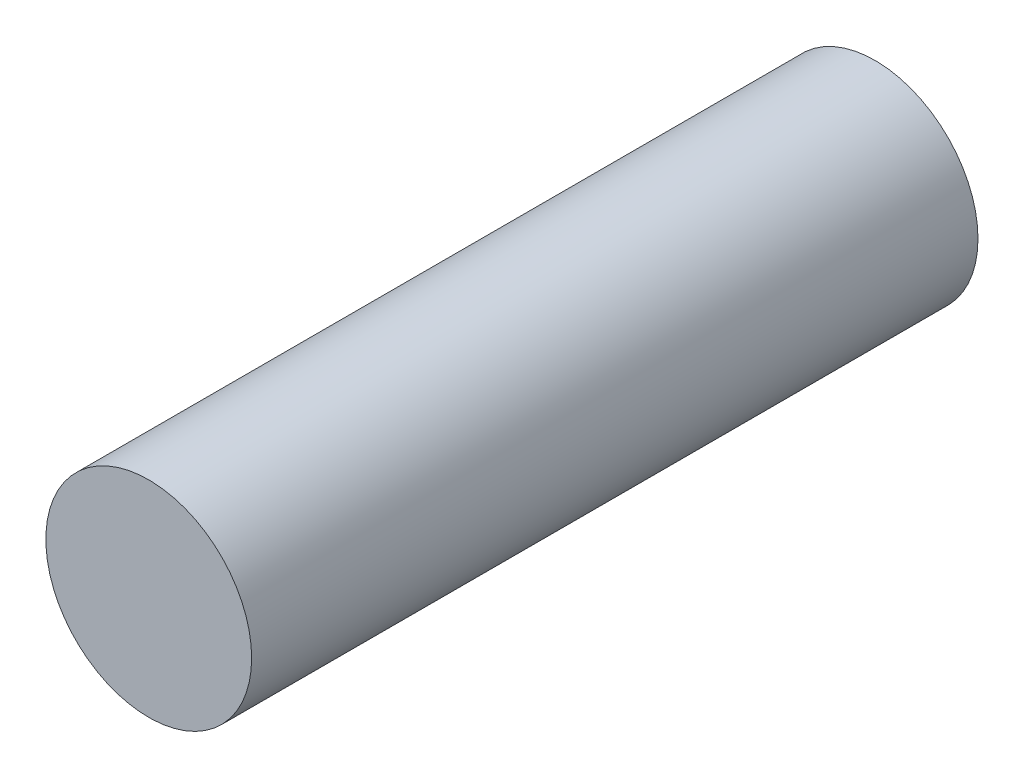
ISO-10303-21;
HEADER;
FILE_DESCRIPTION(('STEP AP214'),'2;1');
FILE_NAME('part.step','',(''),(''),'','','');
FILE_SCHEMA(('AUTOMOTIVE_DESIGN { 1 0 10303 214 1 1 1 1 }'));
ENDSEC;
DATA;
#1=APPLICATION_CONTEXT('core data for automotive mechanical design processes');
#2=APPLICATION_PROTOCOL_DEFINITION('international standard','automotive_design',2000,#1);
#3=PRODUCT_CONTEXT('',#1,'mechanical');
#4=PRODUCT('Part','Part','',(#3));
#5=PRODUCT_RELATED_PRODUCT_CATEGORY('part','',(#4));
#6=PRODUCT_DEFINITION_FORMATION('','',#4);
#7=PRODUCT_DEFINITION_CONTEXT('part definition',#1,'design');
#8=PRODUCT_DEFINITION('design','',#6,#7);
#9=PRODUCT_DEFINITION_SHAPE('','',#8);
#10=(LENGTH_UNIT() NAMED_UNIT(*) SI_UNIT(.MILLI.,.METRE.));
#11=(NAMED_UNIT(*) PLANE_ANGLE_UNIT() SI_UNIT($,.RADIAN.));
#12=(NAMED_UNIT(*) SI_UNIT($,.STERADIAN.) SOLID_ANGLE_UNIT());
#13=UNCERTAINTY_MEASURE_WITH_UNIT(LENGTH_MEASURE(1.E-05),#10,'distance_accuracy_value','');
#14=(GEOMETRIC_REPRESENTATION_CONTEXT(3) GLOBAL_UNCERTAINTY_ASSIGNED_CONTEXT((#13)) GLOBAL_UNIT_ASSIGNED_CONTEXT((#10,
#11,#12)) REPRESENTATION_CONTEXT('',''));
#15=CARTESIAN_POINT('',(0.,0.,0.));
#16=DIRECTION('',(0.,0.,1.));
#17=DIRECTION('',(1.,0.,0.));
#18=AXIS2_PLACEMENT_3D('',#15,#16,#17);
#19=CARTESIAN_POINT('',(0.,0.,300.));
#20=DIRECTION('',(0.,0.,-1.));
#21=DIRECTION('',(-1.,0.,0.));
#22=AXIS2_PLACEMENT_3D('',#19,#20,#21);
#23=CYLINDRICAL_SURFACE('',#22,42.5);
#24=CARTESIAN_POINT('',(0.,0.,300.));
#25=DIRECTION('',(0.,0.,1.));
#26=DIRECTION('',(1.,0.,0.));
#27=AXIS2_PLACEMENT_3D('',#24,#25,#26);
#28=CIRCLE('',#27,42.5);
#29=CARTESIAN_POINT('',(42.5,0.,300.));
#30=VERTEX_POINT('',#29);
#31=EDGE_CURVE('E10',#30,#30,#28,.T.);
#32=ORIENTED_EDGE('',*,*,#31,.F.);
#33=EDGE_LOOP('',(#32));
#34=FACE_BOUND('',#33,.T.);
#35=CARTESIAN_POINT('',(0.,0.,0.));
#36=DIRECTION('',(0.,0.,1.));
#37=DIRECTION('',(1.,0.,0.));
#38=AXIS2_PLACEMENT_3D('',#35,#36,#37);
#39=CIRCLE('',#38,42.5);
#40=CARTESIAN_POINT('',(42.5,0.,0.));
#41=VERTEX_POINT('',#40);
#42=EDGE_CURVE('E44',#41,#41,#39,.T.);
#43=ORIENTED_EDGE('',*,*,#42,.T.);
#44=EDGE_LOOP('',(#43));
#45=FACE_BOUND('',#44,.T.);
#46=ADVANCED_FACE('F41',(#34,#45),#23,.T.);
#47=CARTESIAN_POINT('',(0.,0.,300.));
#48=DIRECTION('',(0.,0.,1.));
#49=DIRECTION('',(1.,0.,0.));
#50=AXIS2_PLACEMENT_3D('',#47,#48,#49);
#51=PLANE('',#50);
#52=ORIENTED_EDGE('',*,*,#31,.T.);
#53=EDGE_LOOP('',(#52));
#54=FACE_BOUND('',#53,.T.);
#55=ADVANCED_FACE('F58',(#54),#51,.T.);
#56=CARTESIAN_POINT('',(0.,0.,0.));
#57=DIRECTION('',(0.,0.,1.));
#58=DIRECTION('',(1.,0.,0.));
#59=AXIS2_PLACEMENT_3D('',#56,#57,#58);
#60=PLANE('',#59);
#61=ORIENTED_EDGE('',*,*,#42,.F.);
#62=EDGE_LOOP('',(#61));
#63=FACE_BOUND('',#62,.T.);
#64=ADVANCED_FACE('F56',(#63),#60,.F.);
#65=CLOSED_SHELL('',(#46,#55,#64));
#66=MANIFOLD_SOLID_BREP('B2',#65);
#67=ADVANCED_BREP_SHAPE_REPRESENTATION('',(#18,#66),#14);
#68=SHAPE_DEFINITION_REPRESENTATION(#9,#67);
ENDSEC;
END-ISO-10303-21;
